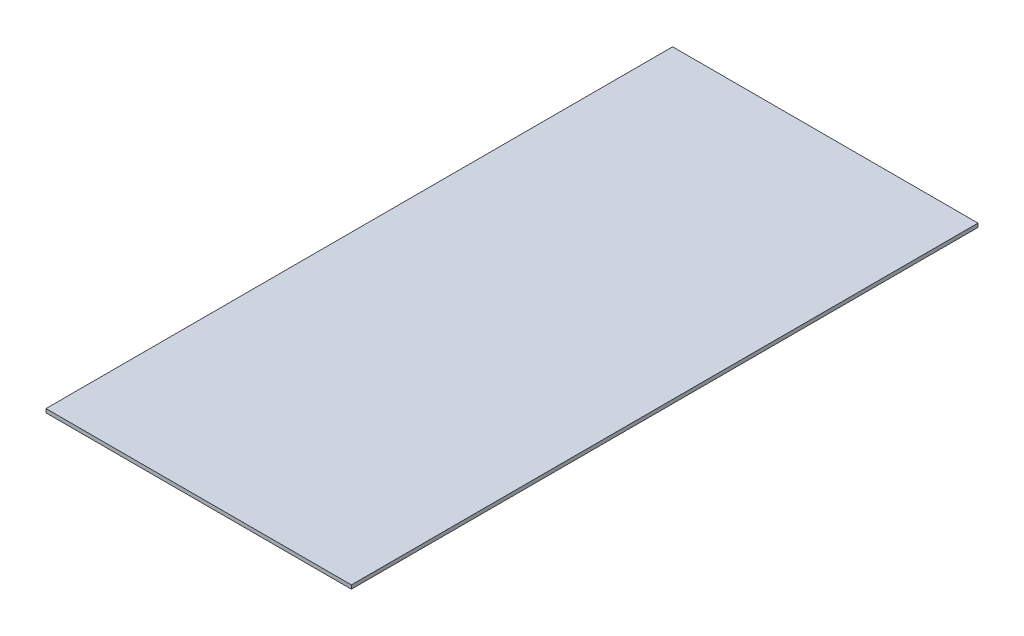
ISO-10303-21;
HEADER;
FILE_DESCRIPTION(('STEP AP214'),'2;1');
FILE_NAME('part.step','',(''),(''),'','','');
FILE_SCHEMA(('AUTOMOTIVE_DESIGN { 1 0 10303 214 1 1 1 1 }'));
ENDSEC;
DATA;
#1=APPLICATION_CONTEXT('core data for automotive mechanical design processes');
#2=APPLICATION_PROTOCOL_DEFINITION('international standard','automotive_design',2000,#1);
#3=PRODUCT_CONTEXT('',#1,'mechanical');
#4=PRODUCT('Part','Part','',(#3));
#5=PRODUCT_RELATED_PRODUCT_CATEGORY('part','',(#4));
#6=PRODUCT_DEFINITION_FORMATION('','',#4);
#7=PRODUCT_DEFINITION_CONTEXT('part definition',#1,'design');
#8=PRODUCT_DEFINITION('design','',#6,#7);
#9=PRODUCT_DEFINITION_SHAPE('','',#8);
#10=(LENGTH_UNIT() NAMED_UNIT(*) SI_UNIT(.MILLI.,.METRE.));
#11=(NAMED_UNIT(*) PLANE_ANGLE_UNIT() SI_UNIT($,.RADIAN.));
#12=(NAMED_UNIT(*) SI_UNIT($,.STERADIAN.) SOLID_ANGLE_UNIT());
#13=UNCERTAINTY_MEASURE_WITH_UNIT(LENGTH_MEASURE(1.E-05),#10,'distance_accuracy_value','');
#14=(GEOMETRIC_REPRESENTATION_CONTEXT(3) GLOBAL_UNCERTAINTY_ASSIGNED_CONTEXT((#13)) GLOBAL_UNIT_ASSIGNED_CONTEXT((#10,
#11,#12)) REPRESENTATION_CONTEXT('',''));
#15=CARTESIAN_POINT('',(0.,0.,0.));
#16=DIRECTION('',(0.,0.,1.));
#17=DIRECTION('',(1.,0.,0.));
#18=AXIS2_PLACEMENT_3D('',#15,#16,#17);
#19=CARTESIAN_POINT('',(-49.0304319030044,89.7294117647059,297.480107645978));
#20=DIRECTION('',(0.,-1.,0.));
#21=DIRECTION('',(1.,0.,0.));
#22=AXIS2_PLACEMENT_3D('',#19,#20,#21);
#23=PLANE('',#22);
#24=DIRECTION('',(1.,0.,0.));
#25=VECTOR('',#24,1.);
#26=CARTESIAN_POINT('',(-49.0304319030044,89.7294117647059,200.));
#27=LINE('',#26,#25);
#28=CARTESIAN_POINT('',(-49.0304319030044,89.7294117647059,200.));
#29=VERTEX_POINT('',#28);
#30=CARTESIAN_POINT('',(-146.503153146805,89.7294117647059,200.));
#31=VERTEX_POINT('',#30);
#32=EDGE_CURVE('E82',#29,#31,#27,.F.);
#33=ORIENTED_EDGE('',*,*,#32,.F.);
#34=DIRECTION('',(0.,0.,-1.));
#35=VECTOR('',#34,1.);
#36=CARTESIAN_POINT('',(-49.0304319030044,89.7294117647059,297.480107645978));
#37=LINE('',#36,#35);
#38=CARTESIAN_POINT('',(-49.0304319030044,89.7294117647059,0.));
#39=VERTEX_POINT('',#38);
#40=EDGE_CURVE('E66',#29,#39,#37,.T.);
#41=ORIENTED_EDGE('',*,*,#40,.T.);
#42=DIRECTION('',(-1.,0.,0.));
#43=VECTOR('',#42,1.);
#44=CARTESIAN_POINT('',(-49.0304319030044,89.7294117647059,0.));
#45=LINE('',#44,#43);
#46=CARTESIAN_POINT('',(-146.503153146805,89.7294117647059,0.));
#47=VERTEX_POINT('',#46);
#48=EDGE_CURVE('E95',#39,#47,#45,.T.);
#49=ORIENTED_EDGE('',*,*,#48,.T.);
#50=DIRECTION('',(0.,0.,-1.));
#51=VECTOR('',#50,1.);
#52=CARTESIAN_POINT('',(-146.503153146805,89.7294117647059,297.480107645978));
#53=LINE('',#52,#51);
#54=EDGE_CURVE('E12',#31,#47,#53,.T.);
#55=ORIENTED_EDGE('',*,*,#54,.F.);
#56=EDGE_LOOP('',(#33,#41,#49,#55));
#57=FACE_BOUND('',#56,.T.);
#58=ADVANCED_FACE('F42',(#57),#23,.F.);
#59=CARTESIAN_POINT('',(-146.503153146805,88.5294117647059,297.480107645978));
#60=DIRECTION('',(-1.,0.,0.));
#61=DIRECTION('',(0.,0.,1.));
#62=AXIS2_PLACEMENT_3D('',#59,#60,#61);
#63=PLANE('',#62);
#64=DIRECTION('',(0.,0.,-1.));
#65=VECTOR('',#64,1.);
#66=CARTESIAN_POINT('',(-146.503153146805,88.5294117647059,297.480107645978));
#67=LINE('',#66,#65);
#68=CARTESIAN_POINT('',(-146.503153146805,88.5294117647059,200.));
#69=VERTEX_POINT('',#68);
#70=CARTESIAN_POINT('',(-146.503153146805,88.5294117647059,0.));
#71=VERTEX_POINT('',#70);
#72=EDGE_CURVE('E51',#69,#71,#67,.T.);
#73=ORIENTED_EDGE('',*,*,#72,.F.);
#74=DIRECTION('',(0.,-1.,0.));
#75=VECTOR('',#74,1.);
#76=CARTESIAN_POINT('',(-146.503153146805,88.5294117647059,200.));
#77=LINE('',#76,#75);
#78=EDGE_CURVE('E85',#69,#31,#77,.F.);
#79=ORIENTED_EDGE('',*,*,#78,.T.);
#80=ORIENTED_EDGE('',*,*,#54,.T.);
#81=DIRECTION('',(0.,1.,0.));
#82=VECTOR('',#81,1.);
#83=CARTESIAN_POINT('',(-146.503153146805,88.5294117647059,0.));
#84=LINE('',#83,#82);
#85=EDGE_CURVE('E102',#71,#47,#84,.T.);
#86=ORIENTED_EDGE('',*,*,#85,.F.);
#87=EDGE_LOOP('',(#73,#79,#80,#86));
#88=FACE_BOUND('',#87,.T.);
#89=ADVANCED_FACE('F92',(#88),#63,.T.);
#90=CARTESIAN_POINT('',(-49.0304319030044,88.5294117647059,297.480107645978));
#91=DIRECTION('',(0.,-1.,0.));
#92=DIRECTION('',(1.,0.,0.));
#93=AXIS2_PLACEMENT_3D('',#90,#91,#92);
#94=PLANE('',#93);
#95=DIRECTION('',(0.,0.,-1.));
#96=VECTOR('',#95,1.);
#97=CARTESIAN_POINT('',(-49.0304319030044,88.5294117647059,297.480107645978));
#98=LINE('',#97,#96);
#99=CARTESIAN_POINT('',(-49.0304319030044,88.5294117647059,200.));
#100=VERTEX_POINT('',#99);
#101=CARTESIAN_POINT('',(-49.0304319030044,88.5294117647059,0.));
#102=VERTEX_POINT('',#101);
#103=EDGE_CURVE('E123',#100,#102,#98,.T.);
#104=ORIENTED_EDGE('',*,*,#103,.F.);
#105=DIRECTION('',(-1.,0.,0.));
#106=VECTOR('',#105,1.);
#107=CARTESIAN_POINT('',(-49.0304319030044,88.5294117647059,200.));
#108=LINE('',#107,#106);
#109=EDGE_CURVE('E58',#100,#69,#108,.T.);
#110=ORIENTED_EDGE('',*,*,#109,.T.);
#111=ORIENTED_EDGE('',*,*,#72,.T.);
#112=DIRECTION('',(-1.,0.,0.));
#113=VECTOR('',#112,1.);
#114=CARTESIAN_POINT('',(-49.0304319030044,88.5294117647059,0.));
#115=LINE('',#114,#113);
#116=EDGE_CURVE('E107',#102,#71,#115,.T.);
#117=ORIENTED_EDGE('',*,*,#116,.F.);
#118=EDGE_LOOP('',(#104,#110,#111,#117));
#119=FACE_BOUND('',#118,.T.);
#120=ADVANCED_FACE('F131',(#119),#94,.T.);
#121=CARTESIAN_POINT('',(-49.0304319030044,89.7294117647059,297.480107645978));
#122=DIRECTION('',(1.,0.,0.));
#123=DIRECTION('',(0.,0.,-1.));
#124=AXIS2_PLACEMENT_3D('',#121,#122,#123);
#125=PLANE('',#124);
#126=ORIENTED_EDGE('',*,*,#40,.F.);
#127=DIRECTION('',(0.,-1.,0.));
#128=VECTOR('',#127,1.);
#129=CARTESIAN_POINT('',(-49.0304319030044,88.5294117647059,200.));
#130=LINE('',#129,#128);
#131=EDGE_CURVE('E86',#100,#29,#130,.F.);
#132=ORIENTED_EDGE('',*,*,#131,.F.);
#133=ORIENTED_EDGE('',*,*,#103,.T.);
#134=DIRECTION('',(0.,-1.,0.));
#135=VECTOR('',#134,1.);
#136=CARTESIAN_POINT('',(-49.0304319030044,89.7294117647059,0.));
#137=LINE('',#136,#135);
#138=EDGE_CURVE('E113',#39,#102,#137,.T.);
#139=ORIENTED_EDGE('',*,*,#138,.F.);
#140=EDGE_LOOP('',(#126,#132,#133,#139));
#141=FACE_BOUND('',#140,.T.);
#142=ADVANCED_FACE('F137',(#141),#125,.T.);
#143=CARTESIAN_POINT('',(0.,0.,0.));
#144=DIRECTION('',(0.,0.,-1.));
#145=DIRECTION('',(-1.,0.,0.));
#146=AXIS2_PLACEMENT_3D('',#143,#144,#145);
#147=PLANE('',#146);
#148=ORIENTED_EDGE('',*,*,#48,.F.);
#149=ORIENTED_EDGE('',*,*,#138,.T.);
#150=ORIENTED_EDGE('',*,*,#116,.T.);
#151=ORIENTED_EDGE('',*,*,#85,.T.);
#152=EDGE_LOOP('',(#148,#149,#150,#151));
#153=FACE_BOUND('',#152,.T.);
#154=ADVANCED_FACE('F105',(#153),#147,.T.);
#155=CARTESIAN_POINT('',(-49.0304319030044,88.5294117647059,200.));
#156=DIRECTION('',(0.,0.,1.));
#157=DIRECTION('',(-1.,0.,0.));
#158=AXIS2_PLACEMENT_3D('',#155,#156,#157);
#159=PLANE('',#158);
#160=ORIENTED_EDGE('',*,*,#78,.F.);
#161=ORIENTED_EDGE('',*,*,#109,.F.);
#162=ORIENTED_EDGE('',*,*,#131,.T.);
#163=ORIENTED_EDGE('',*,*,#32,.T.);
#164=EDGE_LOOP('',(#160,#161,#162,#163));
#165=FACE_BOUND('',#164,.T.);
#166=ADVANCED_FACE('F84',(#165),#159,.T.);
#167=CLOSED_SHELL('',(#58,#89,#120,#142,#154,#166));
#168=MANIFOLD_SOLID_BREP('B2',#167);
#169=ADVANCED_BREP_SHAPE_REPRESENTATION('',(#18,#168),#14);
#170=SHAPE_DEFINITION_REPRESENTATION(#9,#169);
ENDSEC;
END-ISO-10303-21;
